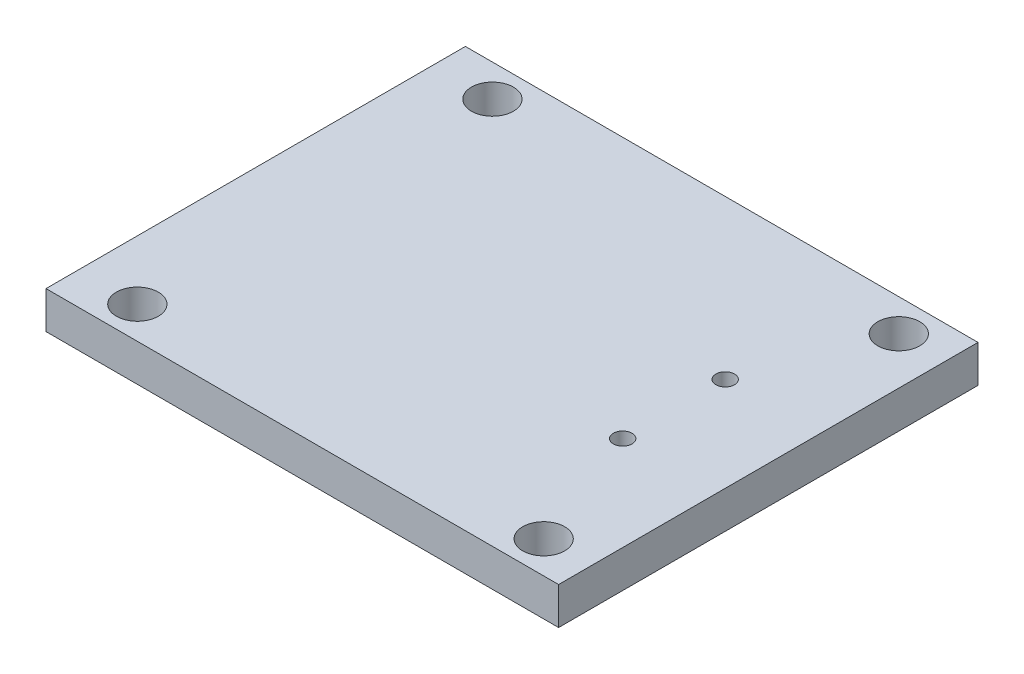
ISO-10303-21;
HEADER;
FILE_DESCRIPTION(('STEP AP214'),'2;1');
FILE_NAME('part.step','',(''),(''),'','','');
FILE_SCHEMA(('AUTOMOTIVE_DESIGN { 1 0 10303 214 1 1 1 1 }'));
ENDSEC;
DATA;
#1=APPLICATION_CONTEXT('core data for automotive mechanical design processes');
#2=APPLICATION_PROTOCOL_DEFINITION('international standard','automotive_design',2000,#1);
#3=PRODUCT_CONTEXT('',#1,'mechanical');
#4=PRODUCT('Part','Part','',(#3));
#5=PRODUCT_RELATED_PRODUCT_CATEGORY('part','',(#4));
#6=PRODUCT_DEFINITION_FORMATION('','',#4);
#7=PRODUCT_DEFINITION_CONTEXT('part definition',#1,'design');
#8=PRODUCT_DEFINITION('design','',#6,#7);
#9=PRODUCT_DEFINITION_SHAPE('','',#8);
#10=(LENGTH_UNIT() NAMED_UNIT(*) SI_UNIT(.MILLI.,.METRE.));
#11=(NAMED_UNIT(*) PLANE_ANGLE_UNIT() SI_UNIT($,.RADIAN.));
#12=(NAMED_UNIT(*) SI_UNIT($,.STERADIAN.) SOLID_ANGLE_UNIT());
#13=UNCERTAINTY_MEASURE_WITH_UNIT(LENGTH_MEASURE(1.E-05),#10,'distance_accuracy_value','');
#14=(GEOMETRIC_REPRESENTATION_CONTEXT(3) GLOBAL_UNCERTAINTY_ASSIGNED_CONTEXT((#13)) GLOBAL_UNIT_ASSIGNED_CONTEXT((#10,
#11,#12)) REPRESENTATION_CONTEXT('',''));
#15=CARTESIAN_POINT('',(0.,0.,0.));
#16=DIRECTION('',(0.,0.,1.));
#17=DIRECTION('',(1.,0.,0.));
#18=AXIS2_PLACEMENT_3D('',#15,#16,#17);
#19=CARTESIAN_POINT('',(0.,1.6,0.));
#20=DIRECTION('',(0.,1.,0.));
#21=DIRECTION('',(0.,0.,1.));
#22=AXIS2_PLACEMENT_3D('',#19,#20,#21);
#23=PLANE('',#22);
#24=CARTESIAN_POINT('',(24.73,1.6,-5.42));
#25=DIRECTION('',(0.,1.,0.));
#26=DIRECTION('',(0.,0.,1.));
#27=AXIS2_PLACEMENT_3D('',#24,#25,#26);
#28=CIRCLE('',#27,0.399999999999998);
#29=CARTESIAN_POINT('',(24.73,1.6,-5.02));
#30=VERTEX_POINT('',#29);
#31=EDGE_CURVE('E135',#30,#30,#28,.F.);
#32=ORIENTED_EDGE('',*,*,#31,.T.);
#33=EDGE_LOOP('',(#32));
#34=FACE_BOUND('',#33,.T.);
#35=CARTESIAN_POINT('',(9.32,1.6,0.));
#36=DIRECTION('',(0.,1.,0.));
#37=DIRECTION('',(0.,0.,1.));
#38=AXIS2_PLACEMENT_3D('',#35,#36,#37);
#39=CIRCLE('',#38,0.9);
#40=CARTESIAN_POINT('',(9.32,1.6,0.9));
#41=VERTEX_POINT('',#40);
#42=EDGE_CURVE('E123',#41,#41,#39,.T.);
#43=ORIENTED_EDGE('',*,*,#42,.F.);
#44=EDGE_LOOP('',(#43));
#45=FACE_BOUND('',#44,.T.);
#46=CARTESIAN_POINT('',(26.76,1.6,-15.24));
#47=DIRECTION('',(0.,1.,0.));
#48=DIRECTION('',(0.,0.,1.));
#49=AXIS2_PLACEMENT_3D('',#46,#47,#48);
#50=CIRCLE('',#49,0.899999999999997);
#51=CARTESIAN_POINT('',(26.76,1.6,-14.34));
#52=VERTEX_POINT('',#51);
#53=EDGE_CURVE('E102',#52,#52,#50,.T.);
#54=ORIENTED_EDGE('',*,*,#53,.F.);
#55=EDGE_LOOP('',(#54));
#56=FACE_BOUND('',#55,.T.);
#57=DIRECTION('',(0.,0.,1.));
#58=VECTOR('',#57,1.);
#59=CARTESIAN_POINT('',(6.78,1.6,-16.62));
#60=LINE('',#59,#58);
#61=CARTESIAN_POINT('',(6.78,1.6,-16.62));
#62=VERTEX_POINT('',#61);
#63=CARTESIAN_POINT('',(6.78,1.6,1.38));
#64=VERTEX_POINT('',#63);
#65=EDGE_CURVE('E87',#62,#64,#60,.T.);
#66=ORIENTED_EDGE('',*,*,#65,.T.);
#67=DIRECTION('',(1.,0.,0.));
#68=VECTOR('',#67,1.);
#69=CARTESIAN_POINT('',(6.78,1.6,1.38));
#70=LINE('',#69,#68);
#71=CARTESIAN_POINT('',(28.78,1.6,1.38));
#72=VERTEX_POINT('',#71);
#73=EDGE_CURVE('E82',#64,#72,#70,.T.);
#74=ORIENTED_EDGE('',*,*,#73,.T.);
#75=DIRECTION('',(0.,0.,-1.));
#76=VECTOR('',#75,1.);
#77=CARTESIAN_POINT('',(28.78,1.6,-16.62));
#78=LINE('',#77,#76);
#79=CARTESIAN_POINT('',(28.78,1.6,-16.62));
#80=VERTEX_POINT('',#79);
#81=EDGE_CURVE('E85',#72,#80,#78,.T.);
#82=ORIENTED_EDGE('',*,*,#81,.T.);
#83=DIRECTION('',(-1.,0.,0.));
#84=VECTOR('',#83,1.);
#85=CARTESIAN_POINT('',(6.78,1.6,-16.62));
#86=LINE('',#85,#84);
#87=EDGE_CURVE('E52',#80,#62,#86,.T.);
#88=ORIENTED_EDGE('',*,*,#87,.T.);
#89=EDGE_LOOP('',(#66,#74,#82,#88));
#90=FACE_BOUND('',#89,.T.);
#91=CARTESIAN_POINT('',(26.76,1.6,0.));
#92=DIRECTION('',(0.,1.,0.));
#93=DIRECTION('',(0.,0.,1.));
#94=AXIS2_PLACEMENT_3D('',#91,#92,#93);
#95=CIRCLE('',#94,0.899999999999997);
#96=CARTESIAN_POINT('',(26.76,1.6,0.899999999999997));
#97=VERTEX_POINT('',#96);
#98=EDGE_CURVE('E117',#97,#97,#95,.T.);
#99=ORIENTED_EDGE('',*,*,#98,.F.);
#100=EDGE_LOOP('',(#99));
#101=FACE_BOUND('',#100,.T.);
#102=CARTESIAN_POINT('',(9.32,1.6,-15.24));
#103=DIRECTION('',(0.,1.,0.));
#104=DIRECTION('',(0.,0.,1.));
#105=AXIS2_PLACEMENT_3D('',#102,#103,#104);
#106=CIRCLE('',#105,0.9);
#107=CARTESIAN_POINT('',(9.32,1.6,-14.34));
#108=VERTEX_POINT('',#107);
#109=EDGE_CURVE('E129',#108,#108,#106,.T.);
#110=ORIENTED_EDGE('',*,*,#109,.F.);
#111=EDGE_LOOP('',(#110));
#112=FACE_BOUND('',#111,.T.);
#113=CARTESIAN_POINT('',(24.73,1.6,-9.82));
#114=DIRECTION('',(0.,1.,0.));
#115=DIRECTION('',(0.,0.,1.));
#116=AXIS2_PLACEMENT_3D('',#113,#114,#115);
#117=CIRCLE('',#116,0.399999999999998);
#118=CARTESIAN_POINT('',(24.73,1.6,-9.42));
#119=VERTEX_POINT('',#118);
#120=EDGE_CURVE('E143',#119,#119,#117,.F.);
#121=ORIENTED_EDGE('',*,*,#120,.T.);
#122=EDGE_LOOP('',(#121));
#123=FACE_BOUND('',#122,.T.);
#124=ADVANCED_FACE('F35',(#34,#45,#56,#90,#101,#112,#123),#23,.T.);
#125=CARTESIAN_POINT('',(0.,0.,0.));
#126=DIRECTION('',(0.,1.,0.));
#127=DIRECTION('',(0.,0.,1.));
#128=AXIS2_PLACEMENT_3D('',#125,#126,#127);
#129=PLANE('',#128);
#130=DIRECTION('',(0.,0.,1.));
#131=VECTOR('',#130,1.);
#132=CARTESIAN_POINT('',(6.78,0.,-16.62));
#133=LINE('',#132,#131);
#134=CARTESIAN_POINT('',(6.78,0.,-16.62));
#135=VERTEX_POINT('',#134);
#136=CARTESIAN_POINT('',(6.78,0.,1.38));
#137=VERTEX_POINT('',#136);
#138=EDGE_CURVE('E99',#135,#137,#133,.T.);
#139=ORIENTED_EDGE('',*,*,#138,.F.);
#140=DIRECTION('',(-1.,0.,0.));
#141=VECTOR('',#140,1.);
#142=CARTESIAN_POINT('',(6.78,0.,-16.62));
#143=LINE('',#142,#141);
#144=CARTESIAN_POINT('',(28.78,0.,-16.62));
#145=VERTEX_POINT('',#144);
#146=EDGE_CURVE('E75',#145,#135,#143,.T.);
#147=ORIENTED_EDGE('',*,*,#146,.F.);
#148=DIRECTION('',(0.,0.,-1.));
#149=VECTOR('',#148,1.);
#150=CARTESIAN_POINT('',(28.78,0.,-16.62));
#151=LINE('',#150,#149);
#152=CARTESIAN_POINT('',(28.78,0.,1.38));
#153=VERTEX_POINT('',#152);
#154=EDGE_CURVE('E69',#153,#145,#151,.T.);
#155=ORIENTED_EDGE('',*,*,#154,.F.);
#156=DIRECTION('',(1.,0.,0.));
#157=VECTOR('',#156,1.);
#158=CARTESIAN_POINT('',(6.78,0.,1.38));
#159=LINE('',#158,#157);
#160=EDGE_CURVE('E91',#137,#153,#159,.T.);
#161=ORIENTED_EDGE('',*,*,#160,.F.);
#162=EDGE_LOOP('',(#139,#147,#155,#161));
#163=FACE_BOUND('',#162,.T.);
#164=CARTESIAN_POINT('',(26.76,0.,-15.24));
#165=DIRECTION('',(0.,1.,0.));
#166=DIRECTION('',(0.,0.,1.));
#167=AXIS2_PLACEMENT_3D('',#164,#165,#166);
#168=CIRCLE('',#167,0.899999999999997);
#169=CARTESIAN_POINT('',(26.76,0.,-14.34));
#170=VERTEX_POINT('',#169);
#171=EDGE_CURVE('E114',#170,#170,#168,.T.);
#172=ORIENTED_EDGE('',*,*,#171,.T.);
#173=EDGE_LOOP('',(#172));
#174=FACE_BOUND('',#173,.T.);
#175=CARTESIAN_POINT('',(26.76,0.,0.));
#176=DIRECTION('',(0.,1.,0.));
#177=DIRECTION('',(0.,0.,1.));
#178=AXIS2_PLACEMENT_3D('',#175,#176,#177);
#179=CIRCLE('',#178,0.899999999999997);
#180=CARTESIAN_POINT('',(26.76,0.,0.899999999999997));
#181=VERTEX_POINT('',#180);
#182=EDGE_CURVE('E120',#181,#181,#179,.T.);
#183=ORIENTED_EDGE('',*,*,#182,.T.);
#184=EDGE_LOOP('',(#183));
#185=FACE_BOUND('',#184,.T.);
#186=CARTESIAN_POINT('',(9.32,0.,0.));
#187=DIRECTION('',(0.,1.,0.));
#188=DIRECTION('',(0.,0.,1.));
#189=AXIS2_PLACEMENT_3D('',#186,#187,#188);
#190=CIRCLE('',#189,0.9);
#191=CARTESIAN_POINT('',(9.32,0.,0.9));
#192=VERTEX_POINT('',#191);
#193=EDGE_CURVE('E126',#192,#192,#190,.T.);
#194=ORIENTED_EDGE('',*,*,#193,.T.);
#195=EDGE_LOOP('',(#194));
#196=FACE_BOUND('',#195,.T.);
#197=CARTESIAN_POINT('',(9.32,0.,-15.24));
#198=DIRECTION('',(0.,1.,0.));
#199=DIRECTION('',(0.,0.,1.));
#200=AXIS2_PLACEMENT_3D('',#197,#198,#199);
#201=CIRCLE('',#200,0.9);
#202=CARTESIAN_POINT('',(9.32,0.,-14.34));
#203=VERTEX_POINT('',#202);
#204=EDGE_CURVE('E132',#203,#203,#201,.T.);
#205=ORIENTED_EDGE('',*,*,#204,.T.);
#206=EDGE_LOOP('',(#205));
#207=FACE_BOUND('',#206,.T.);
#208=CARTESIAN_POINT('',(24.73,0.,-5.42));
#209=DIRECTION('',(0.,1.,0.));
#210=DIRECTION('',(0.,0.,1.));
#211=AXIS2_PLACEMENT_3D('',#208,#209,#210);
#212=CIRCLE('',#211,0.399999999999998);
#213=CARTESIAN_POINT('',(24.73,0.,-5.02));
#214=VERTEX_POINT('',#213);
#215=EDGE_CURVE('E140',#214,#214,#212,.T.);
#216=ORIENTED_EDGE('',*,*,#215,.T.);
#217=EDGE_LOOP('',(#216));
#218=FACE_BOUND('',#217,.T.);
#219=CARTESIAN_POINT('',(24.73,0.,-9.82));
#220=DIRECTION('',(0.,1.,0.));
#221=DIRECTION('',(0.,0.,1.));
#222=AXIS2_PLACEMENT_3D('',#219,#220,#221);
#223=CIRCLE('',#222,0.399999999999998);
#224=CARTESIAN_POINT('',(24.73,0.,-9.42));
#225=VERTEX_POINT('',#224);
#226=EDGE_CURVE('E146',#225,#225,#223,.T.);
#227=ORIENTED_EDGE('',*,*,#226,.T.);
#228=EDGE_LOOP('',(#227));
#229=FACE_BOUND('',#228,.T.);
#230=ADVANCED_FACE('F110',(#163,#174,#185,#196,#207,#218,#229),#129,.F.);
#231=CARTESIAN_POINT('',(6.78,1.6,-16.62));
#232=DIRECTION('',(1.,0.,0.));
#233=DIRECTION('',(0.,0.,-1.));
#234=AXIS2_PLACEMENT_3D('',#231,#232,#233);
#235=PLANE('',#234);
#236=ORIENTED_EDGE('',*,*,#138,.T.);
#237=DIRECTION('',(0.,-1.,0.));
#238=VECTOR('',#237,1.);
#239=CARTESIAN_POINT('',(6.78,1.6,1.38));
#240=LINE('',#239,#238);
#241=EDGE_CURVE('E11',#64,#137,#240,.T.);
#242=ORIENTED_EDGE('',*,*,#241,.F.);
#243=ORIENTED_EDGE('',*,*,#65,.F.);
#244=DIRECTION('',(0.,-1.,0.));
#245=VECTOR('',#244,1.);
#246=CARTESIAN_POINT('',(6.78,1.6,-16.62));
#247=LINE('',#246,#245);
#248=EDGE_CURVE('E95',#62,#135,#247,.T.);
#249=ORIENTED_EDGE('',*,*,#248,.T.);
#250=EDGE_LOOP('',(#236,#242,#243,#249));
#251=FACE_BOUND('',#250,.T.);
#252=ADVANCED_FACE('F37',(#251),#235,.F.);
#253=CARTESIAN_POINT('',(6.78,1.6,1.38));
#254=DIRECTION('',(0.,0.,-1.));
#255=DIRECTION('',(-1.,0.,0.));
#256=AXIS2_PLACEMENT_3D('',#253,#254,#255);
#257=PLANE('',#256);
#258=ORIENTED_EDGE('',*,*,#160,.T.);
#259=DIRECTION('',(0.,-1.,0.));
#260=VECTOR('',#259,1.);
#261=CARTESIAN_POINT('',(28.78,1.6,1.38));
#262=LINE('',#261,#260);
#263=EDGE_CURVE('E44',#72,#153,#262,.T.);
#264=ORIENTED_EDGE('',*,*,#263,.F.);
#265=ORIENTED_EDGE('',*,*,#73,.F.);
#266=ORIENTED_EDGE('',*,*,#241,.T.);
#267=EDGE_LOOP('',(#258,#264,#265,#266));
#268=FACE_BOUND('',#267,.T.);
#269=ADVANCED_FACE('F90',(#268),#257,.F.);
#270=CARTESIAN_POINT('',(28.78,1.6,-16.62));
#271=DIRECTION('',(-1.,0.,0.));
#272=DIRECTION('',(0.,0.,1.));
#273=AXIS2_PLACEMENT_3D('',#270,#271,#272);
#274=PLANE('',#273);
#275=ORIENTED_EDGE('',*,*,#154,.T.);
#276=DIRECTION('',(0.,-1.,0.));
#277=VECTOR('',#276,1.);
#278=CARTESIAN_POINT('',(28.78,1.6,-16.62));
#279=LINE('',#278,#277);
#280=EDGE_CURVE('E92',#80,#145,#279,.T.);
#281=ORIENTED_EDGE('',*,*,#280,.F.);
#282=ORIENTED_EDGE('',*,*,#81,.F.);
#283=ORIENTED_EDGE('',*,*,#263,.T.);
#284=EDGE_LOOP('',(#275,#281,#282,#283));
#285=FACE_BOUND('',#284,.T.);
#286=ADVANCED_FACE('F93',(#285),#274,.F.);
#287=CARTESIAN_POINT('',(6.78,1.6,-16.62));
#288=DIRECTION('',(0.,0.,1.));
#289=DIRECTION('',(1.,0.,0.));
#290=AXIS2_PLACEMENT_3D('',#287,#288,#289);
#291=PLANE('',#290);
#292=ORIENTED_EDGE('',*,*,#146,.T.);
#293=ORIENTED_EDGE('',*,*,#248,.F.);
#294=ORIENTED_EDGE('',*,*,#87,.F.);
#295=ORIENTED_EDGE('',*,*,#280,.T.);
#296=EDGE_LOOP('',(#292,#293,#294,#295));
#297=FACE_BOUND('',#296,.T.);
#298=ADVANCED_FACE('F107',(#297),#291,.F.);
#299=CARTESIAN_POINT('',(26.76,1.6,-15.24));
#300=DIRECTION('',(0.,-1.,0.));
#301=DIRECTION('',(0.,0.,-1.));
#302=AXIS2_PLACEMENT_3D('',#299,#300,#301);
#303=CYLINDRICAL_SURFACE('',#302,0.899999999999997);
#304=ORIENTED_EDGE('',*,*,#53,.T.);
#305=EDGE_LOOP('',(#304));
#306=FACE_BOUND('',#305,.T.);
#307=ORIENTED_EDGE('',*,*,#171,.F.);
#308=EDGE_LOOP('',(#307));
#309=FACE_BOUND('',#308,.T.);
#310=ADVANCED_FACE('F172',(#306,#309),#303,.F.);
#311=CARTESIAN_POINT('',(26.76,1.6,0.));
#312=DIRECTION('',(0.,-1.,0.));
#313=DIRECTION('',(0.,0.,-1.));
#314=AXIS2_PLACEMENT_3D('',#311,#312,#313);
#315=CYLINDRICAL_SURFACE('',#314,0.899999999999997);
#316=ORIENTED_EDGE('',*,*,#98,.T.);
#317=EDGE_LOOP('',(#316));
#318=FACE_BOUND('',#317,.T.);
#319=ORIENTED_EDGE('',*,*,#182,.F.);
#320=EDGE_LOOP('',(#319));
#321=FACE_BOUND('',#320,.T.);
#322=ADVANCED_FACE('F215',(#318,#321),#315,.F.);
#323=CARTESIAN_POINT('',(9.32,1.6,0.));
#324=DIRECTION('',(0.,-1.,0.));
#325=DIRECTION('',(0.,0.,-1.));
#326=AXIS2_PLACEMENT_3D('',#323,#324,#325);
#327=CYLINDRICAL_SURFACE('',#326,0.9);
#328=ORIENTED_EDGE('',*,*,#42,.T.);
#329=EDGE_LOOP('',(#328));
#330=FACE_BOUND('',#329,.T.);
#331=ORIENTED_EDGE('',*,*,#193,.F.);
#332=EDGE_LOOP('',(#331));
#333=FACE_BOUND('',#332,.T.);
#334=ADVANCED_FACE('F205',(#330,#333),#327,.F.);
#335=CARTESIAN_POINT('',(9.32,1.6,-15.24));
#336=DIRECTION('',(0.,-1.,0.));
#337=DIRECTION('',(0.,0.,-1.));
#338=AXIS2_PLACEMENT_3D('',#335,#336,#337);
#339=CYLINDRICAL_SURFACE('',#338,0.9);
#340=ORIENTED_EDGE('',*,*,#109,.T.);
#341=EDGE_LOOP('',(#340));
#342=FACE_BOUND('',#341,.T.);
#343=ORIENTED_EDGE('',*,*,#204,.F.);
#344=EDGE_LOOP('',(#343));
#345=FACE_BOUND('',#344,.T.);
#346=ADVANCED_FACE('F159',(#342,#345),#339,.F.);
#347=CARTESIAN_POINT('',(24.73,10.,-5.42));
#348=DIRECTION('',(0.,-1.,0.));
#349=DIRECTION('',(0.,0.,-1.));
#350=AXIS2_PLACEMENT_3D('',#347,#348,#349);
#351=CYLINDRICAL_SURFACE('',#350,0.399999999999998);
#352=ORIENTED_EDGE('',*,*,#31,.F.);
#353=EDGE_LOOP('',(#352));
#354=FACE_BOUND('',#353,.T.);
#355=ORIENTED_EDGE('',*,*,#215,.F.);
#356=EDGE_LOOP('',(#355));
#357=FACE_BOUND('',#356,.T.);
#358=ADVANCED_FACE('F153',(#354,#357),#351,.F.);
#359=CARTESIAN_POINT('',(24.73,10.,-9.82));
#360=DIRECTION('',(0.,-1.,0.));
#361=DIRECTION('',(0.,0.,-1.));
#362=AXIS2_PLACEMENT_3D('',#359,#360,#361);
#363=CYLINDRICAL_SURFACE('',#362,0.399999999999998);
#364=ORIENTED_EDGE('',*,*,#120,.F.);
#365=EDGE_LOOP('',(#364));
#366=FACE_BOUND('',#365,.T.);
#367=ORIENTED_EDGE('',*,*,#226,.F.);
#368=EDGE_LOOP('',(#367));
#369=FACE_BOUND('',#368,.T.);
#370=ADVANCED_FACE('F151',(#366,#369),#363,.F.);
#371=CLOSED_SHELL('',(#124,#230,#252,#269,#286,#298,#310,#322,#334,#346,#358,#370));
#372=MANIFOLD_SOLID_BREP('B2',#371);
#373=ADVANCED_BREP_SHAPE_REPRESENTATION('',(#18,#372),#14);
#374=SHAPE_DEFINITION_REPRESENTATION(#9,#373);
ENDSEC;
END-ISO-10303-21;
